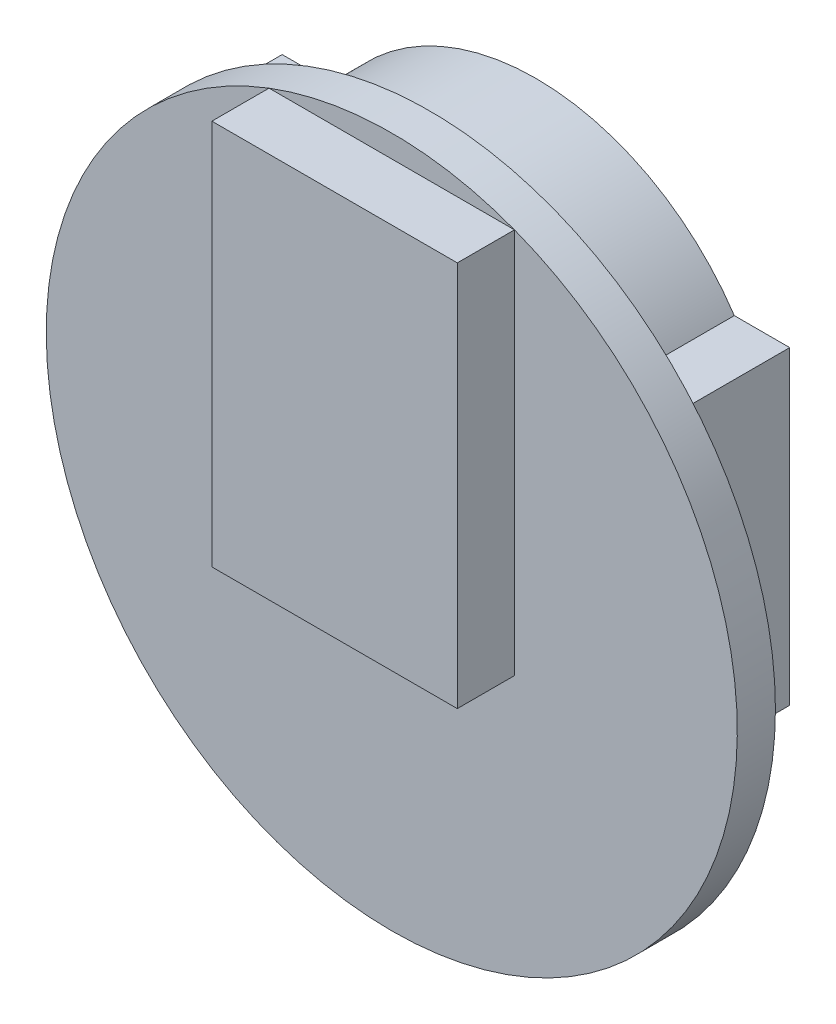
ISO-10303-21;
HEADER;
FILE_DESCRIPTION(('STEP AP214'),'2;1');
FILE_NAME('part.step','',(''),(''),'','','');
FILE_SCHEMA(('AUTOMOTIVE_DESIGN { 1 0 10303 214 1 1 1 1 }'));
ENDSEC;
DATA;
#1=APPLICATION_CONTEXT('core data for automotive mechanical design processes');
#2=APPLICATION_PROTOCOL_DEFINITION('international standard','automotive_design',2000,#1);
#3=PRODUCT_CONTEXT('',#1,'mechanical');
#4=PRODUCT('Part','Part','',(#3));
#5=PRODUCT_RELATED_PRODUCT_CATEGORY('part','',(#4));
#6=PRODUCT_DEFINITION_FORMATION('','',#4);
#7=PRODUCT_DEFINITION_CONTEXT('part definition',#1,'design');
#8=PRODUCT_DEFINITION('design','',#6,#7);
#9=PRODUCT_DEFINITION_SHAPE('','',#8);
#10=(LENGTH_UNIT() NAMED_UNIT(*) SI_UNIT(.MILLI.,.METRE.));
#11=(NAMED_UNIT(*) PLANE_ANGLE_UNIT() SI_UNIT($,.RADIAN.));
#12=(NAMED_UNIT(*) SI_UNIT($,.STERADIAN.) SOLID_ANGLE_UNIT());
#13=UNCERTAINTY_MEASURE_WITH_UNIT(LENGTH_MEASURE(1.E-05),#10,'distance_accuracy_value','');
#14=(GEOMETRIC_REPRESENTATION_CONTEXT(3) GLOBAL_UNCERTAINTY_ASSIGNED_CONTEXT((#13)) GLOBAL_UNIT_ASSIGNED_CONTEXT((#10,
#11,#12)) REPRESENTATION_CONTEXT('',''));
#15=CARTESIAN_POINT('',(0.,0.,0.));
#16=DIRECTION('',(0.,0.,1.));
#17=DIRECTION('',(1.,0.,0.));
#18=AXIS2_PLACEMENT_3D('',#15,#16,#17);
#19=CARTESIAN_POINT('',(0.,0.,-5.2));
#20=DIRECTION('',(0.,0.,-1.));
#21=DIRECTION('',(-1.,0.,0.));
#22=AXIS2_PLACEMENT_3D('',#19,#20,#21);
#23=PLANE('',#22);
#24=DIRECTION('',(0.,-1.,0.));
#25=VECTOR('',#24,1.);
#26=CARTESIAN_POINT('',(-0.708152601596637,-4.2368518694984,-5.2));
#27=LINE('',#26,#25);
#28=CARTESIAN_POINT('',(-0.708152601596637,-4.2368518694984,-5.2));
#29=VERTEX_POINT('',#28);
#30=CARTESIAN_POINT('',(-0.708152601596637,-8.2368518694984,-5.2));
#31=VERTEX_POINT('',#30);
#32=EDGE_CURVE('E221',#29,#31,#27,.T.);
#33=ORIENTED_EDGE('',*,*,#32,.T.);
#34=DIRECTION('',(-1.,0.,0.));
#35=VECTOR('',#34,1.);
#36=CARTESIAN_POINT('',(-0.708152601596637,-8.2368518694984,-5.2));
#37=LINE('',#36,#35);
#38=CARTESIAN_POINT('',(-6.70815260159664,-8.2368518694984,-5.2));
#39=VERTEX_POINT('',#38);
#40=EDGE_CURVE('E224',#31,#39,#37,.T.);
#41=ORIENTED_EDGE('',*,*,#40,.T.);
#42=DIRECTION('',(0.,1.,0.));
#43=VECTOR('',#42,1.);
#44=CARTESIAN_POINT('',(-6.70815260159664,-4.2368518694984,-5.2));
#45=LINE('',#44,#43);
#46=CARTESIAN_POINT('',(-6.70815260159664,-4.2368518694984,-5.2));
#47=VERTEX_POINT('',#46);
#48=EDGE_CURVE('E227',#39,#47,#45,.T.);
#49=ORIENTED_EDGE('',*,*,#48,.T.);
#50=DIRECTION('',(1.,0.,0.));
#51=VECTOR('',#50,1.);
#52=CARTESIAN_POINT('',(-0.708152601596637,-4.2368518694984,-5.2));
#53=LINE('',#52,#51);
#54=EDGE_CURVE('E229',#47,#29,#53,.T.);
#55=ORIENTED_EDGE('',*,*,#54,.T.);
#56=EDGE_LOOP('',(#33,#41,#49,#55));
#57=FACE_BOUND('',#56,.T.);
#58=DIRECTION('',(-1.,0.,0.));
#59=VECTOR('',#58,1.);
#60=CARTESIAN_POINT('',(-2.20815260159664,-6.8868518694984,-5.2));
#61=LINE('',#60,#59);
#62=CARTESIAN_POINT('',(-2.20815260159664,-6.8868518694984,-5.2));
#63=VERTEX_POINT('',#62);
#64=CARTESIAN_POINT('',(-5.20815260159664,-6.8868518694984,-5.2));
#65=VERTEX_POINT('',#64);
#66=EDGE_CURVE('E704',#63,#65,#61,.T.);
#67=ORIENTED_EDGE('',*,*,#66,.F.);
#68=DIRECTION('',(0.,-1.,0.));
#69=VECTOR('',#68,1.);
#70=CARTESIAN_POINT('',(-2.20815260159664,-5.5868518694984,-5.2));
#71=LINE('',#70,#69);
#72=CARTESIAN_POINT('',(-2.20815260159664,-5.5868518694984,-5.2));
#73=VERTEX_POINT('',#72);
#74=EDGE_CURVE('E211',#73,#63,#71,.T.);
#75=ORIENTED_EDGE('',*,*,#74,.F.);
#76=DIRECTION('',(1.,0.,0.));
#77=VECTOR('',#76,1.);
#78=CARTESIAN_POINT('',(-2.20815260159664,-5.5868518694984,-5.2));
#79=LINE('',#78,#77);
#80=CARTESIAN_POINT('',(-5.20815260159664,-5.5868518694984,-5.2));
#81=VERTEX_POINT('',#80);
#82=EDGE_CURVE('E207',#81,#73,#79,.T.);
#83=ORIENTED_EDGE('',*,*,#82,.F.);
#84=DIRECTION('',(0.,1.,0.));
#85=VECTOR('',#84,1.);
#86=CARTESIAN_POINT('',(-5.20815260159664,-5.5868518694984,-5.2));
#87=LINE('',#86,#85);
#88=EDGE_CURVE('E701',#65,#81,#87,.T.);
#89=ORIENTED_EDGE('',*,*,#88,.F.);
#90=EDGE_LOOP('',(#67,#75,#83,#89));
#91=FACE_BOUND('',#90,.T.);
#92=ADVANCED_FACE('F40',(#57,#91),#23,.T.);
#93=CARTESIAN_POINT('',(-3.70815260159664,4.7631481305016,0.));
#94=DIRECTION('',(0.,0.,1.));
#95=DIRECTION('',(1.,0.,0.));
#96=AXIS2_PLACEMENT_3D('',#93,#94,#95);
#97=PLANE('',#96);
#98=CARTESIAN_POINT('',(-3.70815260159664,4.7631481305016,0.));
#99=DIRECTION('',(0.,0.,1.));
#100=DIRECTION('',(1.,0.,0.));
#101=AXIS2_PLACEMENT_3D('',#98,#99,#100);
#102=CIRCLE('',#101,14.5);
#103=CARTESIAN_POINT('',(10.7918473984034,4.7631481305016,0.));
#104=VERTEX_POINT('',#103);
#105=EDGE_CURVE('E44',#104,#104,#102,.T.);
#106=ORIENTED_EDGE('',*,*,#105,.F.);
#107=EDGE_LOOP('',(#106));
#108=FACE_BOUND('',#107,.T.);
#109=DIRECTION('',(0.,-1.,0.));
#110=VECTOR('',#109,1.);
#111=CARTESIAN_POINT('',(-0.708152601596637,-4.2368518694984,0.));
#112=LINE('',#111,#110);
#113=CARTESIAN_POINT('',(-0.708152601596637,-4.2368518694984,0.));
#114=VERTEX_POINT('',#113);
#115=CARTESIAN_POINT('',(-0.708152601596637,-8.2368518694984,0.));
#116=VERTEX_POINT('',#115);
#117=EDGE_CURVE('E213',#114,#116,#112,.T.);
#118=ORIENTED_EDGE('',*,*,#117,.F.);
#119=DIRECTION('',(-1.,0.,0.));
#120=VECTOR('',#119,1.);
#121=CARTESIAN_POINT('',(0.291847398403362,-4.2368518694984,0.));
#122=LINE('',#121,#120);
#123=CARTESIAN_POINT('',(0.291847398403362,-4.2368518694984,0.));
#124=VERTEX_POINT('',#123);
#125=EDGE_CURVE('E277',#124,#114,#122,.T.);
#126=ORIENTED_EDGE('',*,*,#125,.F.);
#127=DIRECTION('',(-0.799278268827735,-0.600961104381756,0.));
#128=VECTOR('',#127,1.);
#129=CARTESIAN_POINT('',(0.291847398403362,-4.2368518694984,0.));
#130=LINE('',#129,#128);
#131=CARTESIAN_POINT('',(6.94184739840337,0.763148130501609,0.));
#132=VERTEX_POINT('',#131);
#133=EDGE_CURVE('E273',#132,#124,#130,.T.);
#134=ORIENTED_EDGE('',*,*,#133,.F.);
#135=DIRECTION('',(0.,-1.,0.));
#136=VECTOR('',#135,1.);
#137=CARTESIAN_POINT('',(6.94184739840337,13.7631481305016,0.));
#138=LINE('',#137,#136);
#139=CARTESIAN_POINT('',(6.94184739840337,13.7631481305016,0.));
#140=VERTEX_POINT('',#139);
#141=EDGE_CURVE('E244',#140,#132,#138,.T.);
#142=ORIENTED_EDGE('',*,*,#141,.F.);
#143=DIRECTION('',(1.,0.,0.));
#144=VECTOR('',#143,1.);
#145=CARTESIAN_POINT('',(6.94184739840337,13.7631481305016,0.));
#146=LINE('',#145,#144);
#147=CARTESIAN_POINT('',(4.61709935081378,13.7631481305016,0.));
#148=VERTEX_POINT('',#147);
#149=EDGE_CURVE('E250',#148,#140,#146,.T.);
#150=ORIENTED_EDGE('',*,*,#149,.F.);
#151=CARTESIAN_POINT('',(-3.70815260159663,8.22327629724711,0.));
#152=DIRECTION('',(0.,0.,-1.));
#153=DIRECTION('',(-1.,0.,0.));
#154=AXIS2_PLACEMENT_3D('',#151,#152,#153);
#155=CIRCLE('',#154,10.);
#156=CARTESIAN_POINT('',(-12.0334045540071,13.7631481305016,0.));
#157=VERTEX_POINT('',#156);
#158=EDGE_CURVE('E289',#157,#148,#155,.T.);
#159=ORIENTED_EDGE('',*,*,#158,.F.);
#160=DIRECTION('',(1.,0.,0.));
#161=VECTOR('',#160,1.);
#162=CARTESIAN_POINT('',(-12.0334045540071,13.7631481305016,0.));
#163=LINE('',#162,#161);
#164=CARTESIAN_POINT('',(-14.3581526015966,13.7631481305016,0.));
#165=VERTEX_POINT('',#164);
#166=EDGE_CURVE('E286',#165,#157,#163,.T.);
#167=ORIENTED_EDGE('',*,*,#166,.F.);
#168=DIRECTION('',(0.,1.,0.));
#169=VECTOR('',#168,1.);
#170=CARTESIAN_POINT('',(-14.3581526015966,13.7631481305016,0.));
#171=LINE('',#170,#169);
#172=CARTESIAN_POINT('',(-14.3581526015966,0.763148130501608,0.));
#173=VERTEX_POINT('',#172);
#174=EDGE_CURVE('E283',#173,#165,#171,.T.);
#175=ORIENTED_EDGE('',*,*,#174,.F.);
#176=DIRECTION('',(-0.799278268827734,0.600961104381756,0.));
#177=VECTOR('',#176,1.);
#178=CARTESIAN_POINT('',(-7.70815260159664,-4.2368518694984,0.));
#179=LINE('',#178,#177);
#180=CARTESIAN_POINT('',(-7.70815260159664,-4.2368518694984,0.));
#181=VERTEX_POINT('',#180);
#182=EDGE_CURVE('E280',#181,#173,#179,.T.);
#183=ORIENTED_EDGE('',*,*,#182,.F.);
#184=CARTESIAN_POINT('',(-6.70815260159664,-4.2368518694984,0.));
#185=VERTEX_POINT('',#184);
#186=EDGE_CURVE('E276',#185,#181,#122,.T.);
#187=ORIENTED_EDGE('',*,*,#186,.F.);
#188=DIRECTION('',(0.,1.,0.));
#189=VECTOR('',#188,1.);
#190=CARTESIAN_POINT('',(-6.70815260159664,-4.2368518694984,0.));
#191=LINE('',#190,#189);
#192=CARTESIAN_POINT('',(-6.70815260159664,-8.2368518694984,0.));
#193=VERTEX_POINT('',#192);
#194=EDGE_CURVE('E225',#193,#185,#191,.T.);
#195=ORIENTED_EDGE('',*,*,#194,.F.);
#196=DIRECTION('',(-1.,0.,0.));
#197=VECTOR('',#196,1.);
#198=CARTESIAN_POINT('',(-0.708152601596637,-8.2368518694984,0.));
#199=LINE('',#198,#197);
#200=EDGE_CURVE('E216',#116,#193,#199,.T.);
#201=ORIENTED_EDGE('',*,*,#200,.F.);
#202=EDGE_LOOP('',(#118,#126,#134,#142,#150,#159,#167,#175,#183,#187,#195,#201));
#203=FACE_BOUND('',#202,.T.);
#204=ADVANCED_FACE('F393',(#108,#203),#97,.F.);
#205=CARTESIAN_POINT('',(0.291847398403362,-4.2368518694984,-4.45));
#206=DIRECTION('',(0.,1.,0.));
#207=DIRECTION('',(-1.,0.,0.));
#208=AXIS2_PLACEMENT_3D('',#205,#206,#207);
#209=PLANE('',#208);
#210=DIRECTION('',(0.,0.,1.));
#211=VECTOR('',#210,1.);
#212=CARTESIAN_POINT('',(-0.708152601596637,-4.2368518694984,-5.2));
#213=LINE('',#212,#211);
#214=CARTESIAN_POINT('',(-0.708152601596637,-4.2368518694984,-4.45));
#215=VERTEX_POINT('',#214);
#216=EDGE_CURVE('E230',#215,#114,#213,.T.);
#217=ORIENTED_EDGE('',*,*,#216,.F.);
#218=DIRECTION('',(-1.,0.,0.));
#219=VECTOR('',#218,1.);
#220=CARTESIAN_POINT('',(0.291847398403362,-4.2368518694984,-4.45));
#221=LINE('',#220,#219);
#222=CARTESIAN_POINT('',(0.291847398403362,-4.2368518694984,-4.45));
#223=VERTEX_POINT('',#222);
#224=EDGE_CURVE('E254',#223,#215,#221,.T.);
#225=ORIENTED_EDGE('',*,*,#224,.F.);
#226=DIRECTION('',(0.,0.,1.));
#227=VECTOR('',#226,1.);
#228=CARTESIAN_POINT('',(0.291847398403362,-4.2368518694984,-4.45));
#229=LINE('',#228,#227);
#230=EDGE_CURVE('E313',#223,#124,#229,.T.);
#231=ORIENTED_EDGE('',*,*,#230,.T.);
#232=ORIENTED_EDGE('',*,*,#125,.T.);
#233=EDGE_LOOP('',(#217,#225,#231,#232));
#234=FACE_BOUND('',#233,.T.);
#235=ADVANCED_FACE('F399',(#234),#209,.F.);
#236=DIRECTION('',(0.,0.,1.));
#237=VECTOR('',#236,1.);
#238=CARTESIAN_POINT('',(-6.70815260159664,-4.2368518694984,-5.2));
#239=LINE('',#238,#237);
#240=CARTESIAN_POINT('',(-6.70815260159664,-4.2368518694984,-4.45));
#241=VERTEX_POINT('',#240);
#242=EDGE_CURVE('E237',#241,#185,#239,.T.);
#243=ORIENTED_EDGE('',*,*,#242,.T.);
#244=ORIENTED_EDGE('',*,*,#186,.T.);
#245=DIRECTION('',(0.,0.,1.));
#246=VECTOR('',#245,1.);
#247=CARTESIAN_POINT('',(-7.70815260159664,-4.2368518694984,-4.45));
#248=LINE('',#247,#246);
#249=CARTESIAN_POINT('',(-7.70815260159664,-4.2368518694984,-4.45));
#250=VERTEX_POINT('',#249);
#251=EDGE_CURVE('E310',#250,#181,#248,.T.);
#252=ORIENTED_EDGE('',*,*,#251,.F.);
#253=EDGE_CURVE('E253',#241,#250,#221,.T.);
#254=ORIENTED_EDGE('',*,*,#253,.F.);
#255=EDGE_LOOP('',(#243,#244,#252,#254));
#256=FACE_BOUND('',#255,.T.);
#257=ADVANCED_FACE('F447',(#256),#209,.F.);
#258=CARTESIAN_POINT('',(-3.70815260159664,4.7631481305016,1.6));
#259=DIRECTION('',(0.,0.,1.));
#260=DIRECTION('',(1.,0.,0.));
#261=AXIS2_PLACEMENT_3D('',#258,#259,#260);
#262=PLANE('',#261);
#263=DIRECTION('',(0.,-1.,0.));
#264=VECTOR('',#263,1.);
#265=CARTESIAN_POINT('',(-8.85815260159664,18.3177598918174,1.6));
#266=LINE('',#265,#264);
#267=CARTESIAN_POINT('',(-8.85815260159664,18.3177598918174,1.6));
#268=VERTEX_POINT('',#267);
#269=CARTESIAN_POINT('',(-8.85815260159663,2.11775989181738,1.6));
#270=VERTEX_POINT('',#269);
#271=EDGE_CURVE('E320',#268,#270,#266,.T.);
#272=ORIENTED_EDGE('',*,*,#271,.F.);
#273=CARTESIAN_POINT('',(-3.70815260159664,4.7631481305016,1.6));
#274=DIRECTION('',(0.,0.,1.));
#275=DIRECTION('',(1.,0.,0.));
#276=AXIS2_PLACEMENT_3D('',#273,#274,#275);
#277=CIRCLE('',#276,14.5);
#278=CARTESIAN_POINT('',(1.44184739840336,18.3177598918174,1.6));
#279=VERTEX_POINT('',#278);
#280=EDGE_CURVE('E49',#268,#279,#277,.T.);
#281=ORIENTED_EDGE('',*,*,#280,.T.);
#282=DIRECTION('',(0.,1.,0.));
#283=VECTOR('',#282,1.);
#284=CARTESIAN_POINT('',(1.44184739840336,18.3177598918174,1.6));
#285=LINE('',#284,#283);
#286=CARTESIAN_POINT('',(1.44184739840337,2.11775989181738,1.6));
#287=VERTEX_POINT('',#286);
#288=EDGE_CURVE('E338',#287,#279,#285,.T.);
#289=ORIENTED_EDGE('',*,*,#288,.F.);
#290=DIRECTION('',(1.,0.,0.));
#291=VECTOR('',#290,1.);
#292=CARTESIAN_POINT('',(-8.85815260159663,2.11775989181738,1.6));
#293=LINE('',#292,#291);
#294=EDGE_CURVE('E335',#270,#287,#293,.T.);
#295=ORIENTED_EDGE('',*,*,#294,.F.);
#296=EDGE_LOOP('',(#272,#281,#289,#295));
#297=FACE_BOUND('',#296,.T.);
#298=ADVANCED_FACE('F365',(#297),#262,.T.);
#299=CARTESIAN_POINT('',(-3.70815260159664,4.7631481305016,1.6));
#300=DIRECTION('',(0.,0.,-1.));
#301=DIRECTION('',(-1.,0.,0.));
#302=AXIS2_PLACEMENT_3D('',#299,#300,#301);
#303=CYLINDRICAL_SURFACE('',#302,14.5);
#304=EDGE_CURVE('E11',#279,#268,#277,.T.);
#305=ORIENTED_EDGE('',*,*,#304,.F.);
#306=ORIENTED_EDGE('',*,*,#280,.F.);
#307=EDGE_LOOP('',(#305,#306));
#308=FACE_BOUND('',#307,.T.);
#309=ORIENTED_EDGE('',*,*,#105,.T.);
#310=EDGE_LOOP('',(#309));
#311=FACE_BOUND('',#310,.T.);
#312=ADVANCED_FACE('F42',(#308,#311),#303,.T.);
#313=DIRECTION('',(-1.,0.,0.));
#314=VECTOR('',#313,1.);
#315=CARTESIAN_POINT('',(-8.85815260159664,18.3177598918174,1.6));
#316=LINE('',#315,#314);
#317=EDGE_CURVE('E325',#279,#268,#316,.T.);
#318=ORIENTED_EDGE('',*,*,#317,.F.);
#319=ORIENTED_EDGE('',*,*,#304,.T.);
#320=EDGE_LOOP('',(#318,#319));
#321=FACE_BOUND('',#320,.T.);
#322=ADVANCED_FACE('F389',(#321),#262,.T.);
#323=CARTESIAN_POINT('',(-8.85815260159664,18.3177598918174,4.));
#324=DIRECTION('',(1.,0.,0.));
#325=DIRECTION('',(0.,1.,0.));
#326=AXIS2_PLACEMENT_3D('',#323,#324,#325);
#327=PLANE('',#326);
#328=ORIENTED_EDGE('',*,*,#271,.T.);
#329=DIRECTION('',(0.,0.,-1.));
#330=VECTOR('',#329,1.);
#331=CARTESIAN_POINT('',(-8.85815260159663,2.11775989181738,4.));
#332=LINE('',#331,#330);
#333=CARTESIAN_POINT('',(-8.85815260159663,2.11775989181738,4.));
#334=VERTEX_POINT('',#333);
#335=EDGE_CURVE('E352',#334,#270,#332,.T.);
#336=ORIENTED_EDGE('',*,*,#335,.F.);
#337=DIRECTION('',(0.,-1.,0.));
#338=VECTOR('',#337,1.);
#339=CARTESIAN_POINT('',(-8.85815260159664,18.3177598918174,4.));
#340=LINE('',#339,#338);
#341=CARTESIAN_POINT('',(-8.85815260159664,18.3177598918174,4.));
#342=VERTEX_POINT('',#341);
#343=EDGE_CURVE('E321',#342,#334,#340,.T.);
#344=ORIENTED_EDGE('',*,*,#343,.F.);
#345=DIRECTION('',(0.,0.,-1.));
#346=VECTOR('',#345,1.);
#347=CARTESIAN_POINT('',(-8.85815260159664,18.3177598918174,4.));
#348=LINE('',#347,#346);
#349=EDGE_CURVE('E332',#342,#268,#348,.T.);
#350=ORIENTED_EDGE('',*,*,#349,.T.);
#351=EDGE_LOOP('',(#328,#336,#344,#350));
#352=FACE_BOUND('',#351,.T.);
#353=ADVANCED_FACE('F382',(#352),#327,.F.);
#354=CARTESIAN_POINT('',(-8.85815260159663,2.11775989181738,4.));
#355=DIRECTION('',(0.,1.,0.));
#356=DIRECTION('',(-1.,0.,0.));
#357=AXIS2_PLACEMENT_3D('',#354,#355,#356);
#358=PLANE('',#357);
#359=ORIENTED_EDGE('',*,*,#294,.T.);
#360=DIRECTION('',(0.,0.,-1.));
#361=VECTOR('',#360,1.);
#362=CARTESIAN_POINT('',(1.44184739840337,2.11775989181738,4.));
#363=LINE('',#362,#361);
#364=CARTESIAN_POINT('',(1.44184739840337,2.11775989181738,4.));
#365=VERTEX_POINT('',#364);
#366=EDGE_CURVE('E349',#365,#287,#363,.T.);
#367=ORIENTED_EDGE('',*,*,#366,.F.);
#368=DIRECTION('',(1.,0.,0.));
#369=VECTOR('',#368,1.);
#370=CARTESIAN_POINT('',(-8.85815260159663,2.11775989181738,4.));
#371=LINE('',#370,#369);
#372=EDGE_CURVE('E324',#334,#365,#371,.T.);
#373=ORIENTED_EDGE('',*,*,#372,.F.);
#374=ORIENTED_EDGE('',*,*,#335,.T.);
#375=EDGE_LOOP('',(#359,#367,#373,#374));
#376=FACE_BOUND('',#375,.T.);
#377=ADVANCED_FACE('F380',(#376),#358,.F.);
#378=CARTESIAN_POINT('',(1.44184739840336,18.3177598918174,4.));
#379=DIRECTION('',(-1.,0.,0.));
#380=DIRECTION('',(0.,-1.,0.));
#381=AXIS2_PLACEMENT_3D('',#378,#379,#380);
#382=PLANE('',#381);
#383=ORIENTED_EDGE('',*,*,#288,.T.);
#384=DIRECTION('',(0.,0.,-1.));
#385=VECTOR('',#384,1.);
#386=CARTESIAN_POINT('',(1.44184739840336,18.3177598918174,4.));
#387=LINE('',#386,#385);
#388=CARTESIAN_POINT('',(1.44184739840336,18.3177598918174,4.));
#389=VERTEX_POINT('',#388);
#390=EDGE_CURVE('E346',#389,#279,#387,.T.);
#391=ORIENTED_EDGE('',*,*,#390,.F.);
#392=DIRECTION('',(0.,1.,0.));
#393=VECTOR('',#392,1.);
#394=CARTESIAN_POINT('',(1.44184739840336,18.3177598918174,4.));
#395=LINE('',#394,#393);
#396=EDGE_CURVE('E327',#365,#389,#395,.T.);
#397=ORIENTED_EDGE('',*,*,#396,.F.);
#398=ORIENTED_EDGE('',*,*,#366,.T.);
#399=EDGE_LOOP('',(#383,#391,#397,#398));
#400=FACE_BOUND('',#399,.T.);
#401=ADVANCED_FACE('F370',(#400),#382,.F.);
#402=CARTESIAN_POINT('',(-8.85815260159664,18.3177598918174,4.));
#403=DIRECTION('',(0.,-1.,0.));
#404=DIRECTION('',(0.,0.,-1.));
#405=AXIS2_PLACEMENT_3D('',#402,#403,#404);
#406=PLANE('',#405);
#407=ORIENTED_EDGE('',*,*,#317,.T.);
#408=ORIENTED_EDGE('',*,*,#349,.F.);
#409=DIRECTION('',(-1.,0.,0.));
#410=VECTOR('',#409,1.);
#411=CARTESIAN_POINT('',(-8.85815260159664,18.3177598918174,4.));
#412=LINE('',#411,#410);
#413=EDGE_CURVE('E330',#389,#342,#412,.T.);
#414=ORIENTED_EDGE('',*,*,#413,.F.);
#415=ORIENTED_EDGE('',*,*,#390,.T.);
#416=EDGE_LOOP('',(#407,#408,#414,#415));
#417=FACE_BOUND('',#416,.T.);
#418=ADVANCED_FACE('F375',(#417),#406,.F.);
#419=CARTESIAN_POINT('',(0.,0.,4.));
#420=DIRECTION('',(0.,0.,1.));
#421=DIRECTION('',(1.,0.,0.));
#422=AXIS2_PLACEMENT_3D('',#419,#420,#421);
#423=PLANE('',#422);
#424=ORIENTED_EDGE('',*,*,#343,.T.);
#425=ORIENTED_EDGE('',*,*,#372,.T.);
#426=ORIENTED_EDGE('',*,*,#396,.T.);
#427=ORIENTED_EDGE('',*,*,#413,.T.);
#428=EDGE_LOOP('',(#424,#425,#426,#427));
#429=FACE_BOUND('',#428,.T.);
#430=ADVANCED_FACE('F379',(#429),#423,.T.);
#431=CARTESIAN_POINT('',(6.94184739840337,13.7631481305016,-4.45));
#432=DIRECTION('',(-1.,0.,0.));
#433=DIRECTION('',(0.,-1.,0.));
#434=AXIS2_PLACEMENT_3D('',#431,#432,#433);
#435=PLANE('',#434);
#436=ORIENTED_EDGE('',*,*,#141,.T.);
#437=DIRECTION('',(0.,0.,1.));
#438=VECTOR('',#437,1.);
#439=CARTESIAN_POINT('',(6.94184739840337,0.763148130501608,-4.45));
#440=LINE('',#439,#438);
#441=CARTESIAN_POINT('',(6.94184739840337,0.763148130501608,-4.45));
#442=VERTEX_POINT('',#441);
#443=EDGE_CURVE('E316',#442,#132,#440,.T.);
#444=ORIENTED_EDGE('',*,*,#443,.F.);
#445=DIRECTION('',(0.,-1.,0.));
#446=VECTOR('',#445,1.);
#447=CARTESIAN_POINT('',(6.94184739840337,13.7631481305016,-4.45));
#448=LINE('',#447,#446);
#449=CARTESIAN_POINT('',(6.94184739840337,13.7631481305016,-4.45));
#450=VERTEX_POINT('',#449);
#451=EDGE_CURVE('E245',#450,#442,#448,.T.);
#452=ORIENTED_EDGE('',*,*,#451,.F.);
#453=DIRECTION('',(0.,0.,1.));
#454=VECTOR('',#453,1.);
#455=CARTESIAN_POINT('',(6.94184739840337,13.7631481305016,-4.45));
#456=LINE('',#455,#454);
#457=EDGE_CURVE('E269',#450,#140,#456,.T.);
#458=ORIENTED_EDGE('',*,*,#457,.T.);
#459=EDGE_LOOP('',(#436,#444,#452,#458));
#460=FACE_BOUND('',#459,.T.);
#461=ADVANCED_FACE('F451',(#460),#435,.F.);
#462=CARTESIAN_POINT('',(0.291847398403362,-4.2368518694984,-4.45));
#463=DIRECTION('',(-0.600961104381756,0.799278268827735,0.));
#464=DIRECTION('',(-0.799278268827735,-0.600961104381756,0.));
#465=AXIS2_PLACEMENT_3D('',#462,#463,#464);
#466=PLANE('',#465);
#467=ORIENTED_EDGE('',*,*,#133,.T.);
#468=ORIENTED_EDGE('',*,*,#230,.F.);
#469=DIRECTION('',(-0.799278268827735,-0.600961104381756,0.));
#470=VECTOR('',#469,1.);
#471=CARTESIAN_POINT('',(0.291847398403362,-4.2368518694984,-4.45));
#472=LINE('',#471,#470);
#473=EDGE_CURVE('E249',#442,#223,#472,.T.);
#474=ORIENTED_EDGE('',*,*,#473,.F.);
#475=ORIENTED_EDGE('',*,*,#443,.T.);
#476=EDGE_LOOP('',(#467,#468,#474,#475));
#477=FACE_BOUND('',#476,.T.);
#478=ADVANCED_FACE('F443',(#477),#466,.F.);
#479=CARTESIAN_POINT('',(-7.70815260159664,-4.2368518694984,-4.45));
#480=DIRECTION('',(0.600961104381756,0.799278268827735,0.));
#481=DIRECTION('',(-0.799278268827735,0.600961104381756,0.));
#482=AXIS2_PLACEMENT_3D('',#479,#480,#481);
#483=PLANE('',#482);
#484=ORIENTED_EDGE('',*,*,#182,.T.);
#485=DIRECTION('',(0.,0.,1.));
#486=VECTOR('',#485,1.);
#487=CARTESIAN_POINT('',(-14.3581526015966,0.763148130501608,-4.45));
#488=LINE('',#487,#486);
#489=CARTESIAN_POINT('',(-14.3581526015966,0.763148130501608,-4.45));
#490=VERTEX_POINT('',#489);
#491=EDGE_CURVE('E307',#490,#173,#488,.T.);
#492=ORIENTED_EDGE('',*,*,#491,.F.);
#493=DIRECTION('',(-0.799278268827734,0.600961104381756,0.));
#494=VECTOR('',#493,1.);
#495=CARTESIAN_POINT('',(-7.70815260159664,-4.2368518694984,-4.45));
#496=LINE('',#495,#494);
#497=EDGE_CURVE('E257',#250,#490,#496,.T.);
#498=ORIENTED_EDGE('',*,*,#497,.F.);
#499=ORIENTED_EDGE('',*,*,#251,.T.);
#500=EDGE_LOOP('',(#484,#492,#498,#499));
#501=FACE_BOUND('',#500,.T.);
#502=ADVANCED_FACE('F439',(#501),#483,.F.);
#503=CARTESIAN_POINT('',(-14.3581526015966,13.7631481305016,-4.45));
#504=DIRECTION('',(1.,0.,0.));
#505=DIRECTION('',(0.,1.,0.));
#506=AXIS2_PLACEMENT_3D('',#503,#504,#505);
#507=PLANE('',#506);
#508=ORIENTED_EDGE('',*,*,#174,.T.);
#509=DIRECTION('',(0.,0.,1.));
#510=VECTOR('',#509,1.);
#511=CARTESIAN_POINT('',(-14.3581526015966,13.7631481305016,-4.45));
#512=LINE('',#511,#510);
#513=CARTESIAN_POINT('',(-14.3581526015966,13.7631481305016,-4.45));
#514=VERTEX_POINT('',#513);
#515=EDGE_CURVE('E304',#514,#165,#512,.T.);
#516=ORIENTED_EDGE('',*,*,#515,.F.);
#517=DIRECTION('',(0.,1.,0.));
#518=VECTOR('',#517,1.);
#519=CARTESIAN_POINT('',(-14.3581526015966,13.7631481305016,-4.45));
#520=LINE('',#519,#518);
#521=EDGE_CURVE('E260',#490,#514,#520,.T.);
#522=ORIENTED_EDGE('',*,*,#521,.F.);
#523=ORIENTED_EDGE('',*,*,#491,.T.);
#524=EDGE_LOOP('',(#508,#516,#522,#523));
#525=FACE_BOUND('',#524,.T.);
#526=ADVANCED_FACE('F435',(#525),#507,.F.);
#527=CARTESIAN_POINT('',(-12.0334045540071,13.7631481305016,-4.45));
#528=DIRECTION('',(0.,-1.,0.));
#529=DIRECTION('',(1.,0.,0.));
#530=AXIS2_PLACEMENT_3D('',#527,#528,#529);
#531=PLANE('',#530);
#532=ORIENTED_EDGE('',*,*,#166,.T.);
#533=DIRECTION('',(0.,0.,1.));
#534=VECTOR('',#533,1.);
#535=CARTESIAN_POINT('',(-12.0334045540071,13.7631481305016,-4.45));
#536=LINE('',#535,#534);
#537=CARTESIAN_POINT('',(-12.0334045540071,13.7631481305016,-4.45));
#538=VERTEX_POINT('',#537);
#539=EDGE_CURVE('E301',#538,#157,#536,.T.);
#540=ORIENTED_EDGE('',*,*,#539,.F.);
#541=DIRECTION('',(1.,0.,0.));
#542=VECTOR('',#541,1.);
#543=CARTESIAN_POINT('',(-12.0334045540071,13.7631481305016,-4.45));
#544=LINE('',#543,#542);
#545=EDGE_CURVE('E262',#514,#538,#544,.T.);
#546=ORIENTED_EDGE('',*,*,#545,.F.);
#547=ORIENTED_EDGE('',*,*,#515,.T.);
#548=EDGE_LOOP('',(#532,#540,#546,#547));
#549=FACE_BOUND('',#548,.T.);
#550=ADVANCED_FACE('F431',(#549),#531,.F.);
#551=CARTESIAN_POINT('',(-3.70815260159663,8.22327629724711,-4.45));
#552=DIRECTION('',(0.,0.,1.));
#553=DIRECTION('',(1.,0.,0.));
#554=AXIS2_PLACEMENT_3D('',#551,#552,#553);
#555=CYLINDRICAL_SURFACE('',#554,10.);
#556=ORIENTED_EDGE('',*,*,#158,.T.);
#557=DIRECTION('',(0.,0.,1.));
#558=VECTOR('',#557,1.);
#559=CARTESIAN_POINT('',(4.61709935081378,13.7631481305016,-4.45));
#560=LINE('',#559,#558);
#561=CARTESIAN_POINT('',(4.61709935081378,13.7631481305016,-4.45));
#562=VERTEX_POINT('',#561);
#563=EDGE_CURVE('E298',#562,#148,#560,.T.);
#564=ORIENTED_EDGE('',*,*,#563,.F.);
#565=CARTESIAN_POINT('',(-3.70815260159663,8.22327629724711,-4.45));
#566=DIRECTION('',(0.,0.,-1.));
#567=DIRECTION('',(-1.,0.,0.));
#568=AXIS2_PLACEMENT_3D('',#565,#566,#567);
#569=CIRCLE('',#568,10.);
#570=EDGE_CURVE('E264',#538,#562,#569,.T.);
#571=ORIENTED_EDGE('',*,*,#570,.F.);
#572=ORIENTED_EDGE('',*,*,#539,.T.);
#573=EDGE_LOOP('',(#556,#564,#571,#572));
#574=FACE_BOUND('',#573,.T.);
#575=ADVANCED_FACE('F427',(#574),#555,.T.);
#576=CARTESIAN_POINT('',(6.94184739840337,13.7631481305016,-4.45));
#577=DIRECTION('',(0.,-1.,0.));
#578=DIRECTION('',(0.,0.,-1.));
#579=AXIS2_PLACEMENT_3D('',#576,#577,#578);
#580=PLANE('',#579);
#581=ORIENTED_EDGE('',*,*,#149,.T.);
#582=ORIENTED_EDGE('',*,*,#457,.F.);
#583=DIRECTION('',(1.,0.,0.));
#584=VECTOR('',#583,1.);
#585=CARTESIAN_POINT('',(6.94184739840337,13.7631481305016,-4.45));
#586=LINE('',#585,#584);
#587=EDGE_CURVE('E266',#562,#450,#586,.T.);
#588=ORIENTED_EDGE('',*,*,#587,.F.);
#589=ORIENTED_EDGE('',*,*,#563,.T.);
#590=EDGE_LOOP('',(#581,#582,#588,#589));
#591=FACE_BOUND('',#590,.T.);
#592=ADVANCED_FACE('F423',(#591),#580,.F.);
#593=CARTESIAN_POINT('',(-3.70815260159663,8.22327629724711,-4.45));
#594=DIRECTION('',(0.,0.,-1.));
#595=DIRECTION('',(-1.,0.,0.));
#596=AXIS2_PLACEMENT_3D('',#593,#594,#595);
#597=PLANE('',#596);
#598=ORIENTED_EDGE('',*,*,#451,.T.);
#599=ORIENTED_EDGE('',*,*,#473,.T.);
#600=ORIENTED_EDGE('',*,*,#224,.T.);
#601=EDGE_CURVE('E258',#215,#241,#221,.T.);
#602=ORIENTED_EDGE('',*,*,#601,.T.);
#603=ORIENTED_EDGE('',*,*,#253,.T.);
#604=ORIENTED_EDGE('',*,*,#497,.T.);
#605=ORIENTED_EDGE('',*,*,#521,.T.);
#606=ORIENTED_EDGE('',*,*,#545,.T.);
#607=ORIENTED_EDGE('',*,*,#570,.T.);
#608=ORIENTED_EDGE('',*,*,#587,.T.);
#609=EDGE_LOOP('',(#598,#599,#600,#602,#603,#604,#605,#606,#607,#608));
#610=FACE_BOUND('',#609,.T.);
#611=ADVANCED_FACE('F419',(#610),#597,.T.);
#612=CARTESIAN_POINT('',(-0.708152601596637,-4.2368518694984,-5.2));
#613=DIRECTION('',(-1.,0.,0.));
#614=DIRECTION('',(0.,0.,1.));
#615=AXIS2_PLACEMENT_3D('',#612,#613,#614);
#616=PLANE('',#615);
#617=ORIENTED_EDGE('',*,*,#117,.T.);
#618=DIRECTION('',(0.,0.,1.));
#619=VECTOR('',#618,1.);
#620=CARTESIAN_POINT('',(-0.708152601596637,-8.2368518694984,-5.2));
#621=LINE('',#620,#619);
#622=EDGE_CURVE('E242',#31,#116,#621,.T.);
#623=ORIENTED_EDGE('',*,*,#622,.F.);
#624=ORIENTED_EDGE('',*,*,#32,.F.);
#625=EDGE_CURVE('E234',#29,#215,#213,.T.);
#626=ORIENTED_EDGE('',*,*,#625,.T.);
#627=ORIENTED_EDGE('',*,*,#216,.T.);
#628=EDGE_LOOP('',(#617,#623,#624,#626,#627));
#629=FACE_BOUND('',#628,.T.);
#630=ADVANCED_FACE('F415',(#629),#616,.F.);
#631=CARTESIAN_POINT('',(-0.708152601596637,-8.2368518694984,-5.2));
#632=DIRECTION('',(0.,1.,0.));
#633=DIRECTION('',(0.,0.,1.));
#634=AXIS2_PLACEMENT_3D('',#631,#632,#633);
#635=PLANE('',#634);
#636=ORIENTED_EDGE('',*,*,#200,.T.);
#637=DIRECTION('',(0.,0.,1.));
#638=VECTOR('',#637,1.);
#639=CARTESIAN_POINT('',(-6.70815260159664,-8.2368518694984,-5.2));
#640=LINE('',#639,#638);
#641=EDGE_CURVE('E239',#39,#193,#640,.T.);
#642=ORIENTED_EDGE('',*,*,#641,.F.);
#643=ORIENTED_EDGE('',*,*,#40,.F.);
#644=ORIENTED_EDGE('',*,*,#622,.T.);
#645=EDGE_LOOP('',(#636,#642,#643,#644));
#646=FACE_BOUND('',#645,.T.);
#647=ADVANCED_FACE('F411',(#646),#635,.F.);
#648=CARTESIAN_POINT('',(-6.70815260159664,-4.2368518694984,-5.2));
#649=DIRECTION('',(1.,0.,0.));
#650=DIRECTION('',(0.,1.,0.));
#651=AXIS2_PLACEMENT_3D('',#648,#649,#650);
#652=PLANE('',#651);
#653=ORIENTED_EDGE('',*,*,#194,.T.);
#654=ORIENTED_EDGE('',*,*,#242,.F.);
#655=EDGE_CURVE('E64',#47,#241,#239,.T.);
#656=ORIENTED_EDGE('',*,*,#655,.F.);
#657=ORIENTED_EDGE('',*,*,#48,.F.);
#658=ORIENTED_EDGE('',*,*,#641,.T.);
#659=EDGE_LOOP('',(#653,#654,#656,#657,#658));
#660=FACE_BOUND('',#659,.T.);
#661=ADVANCED_FACE('F408',(#660),#652,.F.);
#662=CARTESIAN_POINT('',(-0.708152601596637,-4.2368518694984,-5.2));
#663=DIRECTION('',(0.,-1.,0.));
#664=DIRECTION('',(1.,0.,0.));
#665=AXIS2_PLACEMENT_3D('',#662,#663,#664);
#666=PLANE('',#665);
#667=ORIENTED_EDGE('',*,*,#601,.F.);
#668=ORIENTED_EDGE('',*,*,#625,.F.);
#669=ORIENTED_EDGE('',*,*,#54,.F.);
#670=ORIENTED_EDGE('',*,*,#655,.T.);
#671=EDGE_LOOP('',(#667,#668,#669,#670));
#672=FACE_BOUND('',#671,.T.);
#673=ADVANCED_FACE('F405',(#672),#666,.F.);
#674=CARTESIAN_POINT('',(-2.20815260159664,-5.5868518694984,-6.8));
#675=DIRECTION('',(-1.,0.,0.));
#676=DIRECTION('',(0.,0.,1.));
#677=AXIS2_PLACEMENT_3D('',#674,#675,#676);
#678=PLANE('',#677);
#679=ORIENTED_EDGE('',*,*,#74,.T.);
#680=DIRECTION('',(0.,0.,1.));
#681=VECTOR('',#680,1.);
#682=CARTESIAN_POINT('',(-2.20815260159664,-6.8868518694984,-6.8));
#683=LINE('',#682,#681);
#684=CARTESIAN_POINT('',(-2.20815260159664,-6.8868518694984,-6.8));
#685=VERTEX_POINT('',#684);
#686=EDGE_CURVE('E192',#685,#63,#683,.T.);
#687=ORIENTED_EDGE('',*,*,#686,.F.);
#688=DIRECTION('',(0.,-1.,0.));
#689=VECTOR('',#688,1.);
#690=CARTESIAN_POINT('',(-2.20815260159664,-5.5868518694984,-6.8));
#691=LINE('',#690,#689);
#692=CARTESIAN_POINT('',(-2.20815260159664,-5.5868518694984,-6.8));
#693=VERTEX_POINT('',#692);
#694=EDGE_CURVE('E199',#693,#685,#691,.T.);
#695=ORIENTED_EDGE('',*,*,#694,.F.);
#696=DIRECTION('',(0.,0.,1.));
#697=VECTOR('',#696,1.);
#698=CARTESIAN_POINT('',(-2.20815260159664,-5.5868518694984,-6.8));
#699=LINE('',#698,#697);
#700=EDGE_CURVE('E699',#693,#73,#699,.T.);
#701=ORIENTED_EDGE('',*,*,#700,.T.);
#702=EDGE_LOOP('',(#679,#687,#695,#701));
#703=FACE_BOUND('',#702,.T.);
#704=ADVANCED_FACE('F209',(#703),#678,.F.);
#705=CARTESIAN_POINT('',(-2.20815260159664,-6.8868518694984,-6.8));
#706=DIRECTION('',(0.,1.,0.));
#707=DIRECTION('',(-1.,0.,0.));
#708=AXIS2_PLACEMENT_3D('',#705,#706,#707);
#709=PLANE('',#708);
#710=ORIENTED_EDGE('',*,*,#66,.T.);
#711=DIRECTION('',(0.,0.,1.));
#712=VECTOR('',#711,1.);
#713=CARTESIAN_POINT('',(-5.20815260159664,-6.8868518694984,-6.8));
#714=LINE('',#713,#712);
#715=CARTESIAN_POINT('',(-5.20815260159664,-6.8868518694984,-6.8));
#716=VERTEX_POINT('',#715);
#717=EDGE_CURVE('E195',#716,#65,#714,.T.);
#718=ORIENTED_EDGE('',*,*,#717,.F.);
#719=DIRECTION('',(-1.,0.,0.));
#720=VECTOR('',#719,1.);
#721=CARTESIAN_POINT('',(-2.20815260159664,-6.8868518694984,-6.8));
#722=LINE('',#721,#720);
#723=EDGE_CURVE('E188',#685,#716,#722,.T.);
#724=ORIENTED_EDGE('',*,*,#723,.F.);
#725=ORIENTED_EDGE('',*,*,#686,.T.);
#726=EDGE_LOOP('',(#710,#718,#724,#725));
#727=FACE_BOUND('',#726,.T.);
#728=ADVANCED_FACE('F190',(#727),#709,.F.);
#729=CARTESIAN_POINT('',(-5.20815260159664,-5.5868518694984,-6.8));
#730=DIRECTION('',(1.,0.,0.));
#731=DIRECTION('',(0.,0.,-1.));
#732=AXIS2_PLACEMENT_3D('',#729,#730,#731);
#733=PLANE('',#732);
#734=ORIENTED_EDGE('',*,*,#88,.T.);
#735=DIRECTION('',(0.,0.,1.));
#736=VECTOR('',#735,1.);
#737=CARTESIAN_POINT('',(-5.20815260159664,-5.5868518694984,-6.8));
#738=LINE('',#737,#736);
#739=CARTESIAN_POINT('',(-5.20815260159664,-5.5868518694984,-6.8));
#740=VERTEX_POINT('',#739);
#741=EDGE_CURVE('E56',#740,#81,#738,.T.);
#742=ORIENTED_EDGE('',*,*,#741,.F.);
#743=DIRECTION('',(0.,1.,0.));
#744=VECTOR('',#743,1.);
#745=CARTESIAN_POINT('',(-5.20815260159664,-5.5868518694984,-6.8));
#746=LINE('',#745,#744);
#747=EDGE_CURVE('E198',#716,#740,#746,.T.);
#748=ORIENTED_EDGE('',*,*,#747,.F.);
#749=ORIENTED_EDGE('',*,*,#717,.T.);
#750=EDGE_LOOP('',(#734,#742,#748,#749));
#751=FACE_BOUND('',#750,.T.);
#752=ADVANCED_FACE('F529',(#751),#733,.F.);
#753=CARTESIAN_POINT('',(-2.20815260159664,-5.5868518694984,-6.8));
#754=DIRECTION('',(0.,-1.,0.));
#755=DIRECTION('',(0.,0.,-1.));
#756=AXIS2_PLACEMENT_3D('',#753,#754,#755);
#757=PLANE('',#756);
#758=ORIENTED_EDGE('',*,*,#82,.T.);
#759=ORIENTED_EDGE('',*,*,#700,.F.);
#760=DIRECTION('',(1.,0.,0.));
#761=VECTOR('',#760,1.);
#762=CARTESIAN_POINT('',(-2.20815260159664,-5.5868518694984,-6.8));
#763=LINE('',#762,#761);
#764=EDGE_CURVE('E203',#740,#693,#763,.T.);
#765=ORIENTED_EDGE('',*,*,#764,.F.);
#766=ORIENTED_EDGE('',*,*,#741,.T.);
#767=EDGE_LOOP('',(#758,#759,#765,#766));
#768=FACE_BOUND('',#767,.T.);
#769=ADVANCED_FACE('F536',(#768),#757,.F.);
#770=CARTESIAN_POINT('',(0.,0.,-6.8));
#771=DIRECTION('',(0.,0.,-1.));
#772=DIRECTION('',(-1.,0.,0.));
#773=AXIS2_PLACEMENT_3D('',#770,#771,#772);
#774=PLANE('',#773);
#775=ORIENTED_EDGE('',*,*,#694,.T.);
#776=ORIENTED_EDGE('',*,*,#723,.T.);
#777=ORIENTED_EDGE('',*,*,#747,.T.);
#778=ORIENTED_EDGE('',*,*,#764,.T.);
#779=EDGE_LOOP('',(#775,#776,#777,#778));
#780=FACE_BOUND('',#779,.T.);
#781=ADVANCED_FACE('F202',(#780),#774,.T.);
#782=CLOSED_SHELL('',(#92,#204,#235,#257,#298,#312,#322,#353,#377,#401,#418,#430,#461,#478,#502,
#526,#550,#575,#592,#611,#630,#647,#661,#673,#704,#728,#752,#769,#781));
#783=MANIFOLD_SOLID_BREP('B2',#782);
#784=ADVANCED_BREP_SHAPE_REPRESENTATION('',(#18,#783),#14);
#785=SHAPE_DEFINITION_REPRESENTATION(#9,#784);
ENDSEC;
END-ISO-10303-21;
